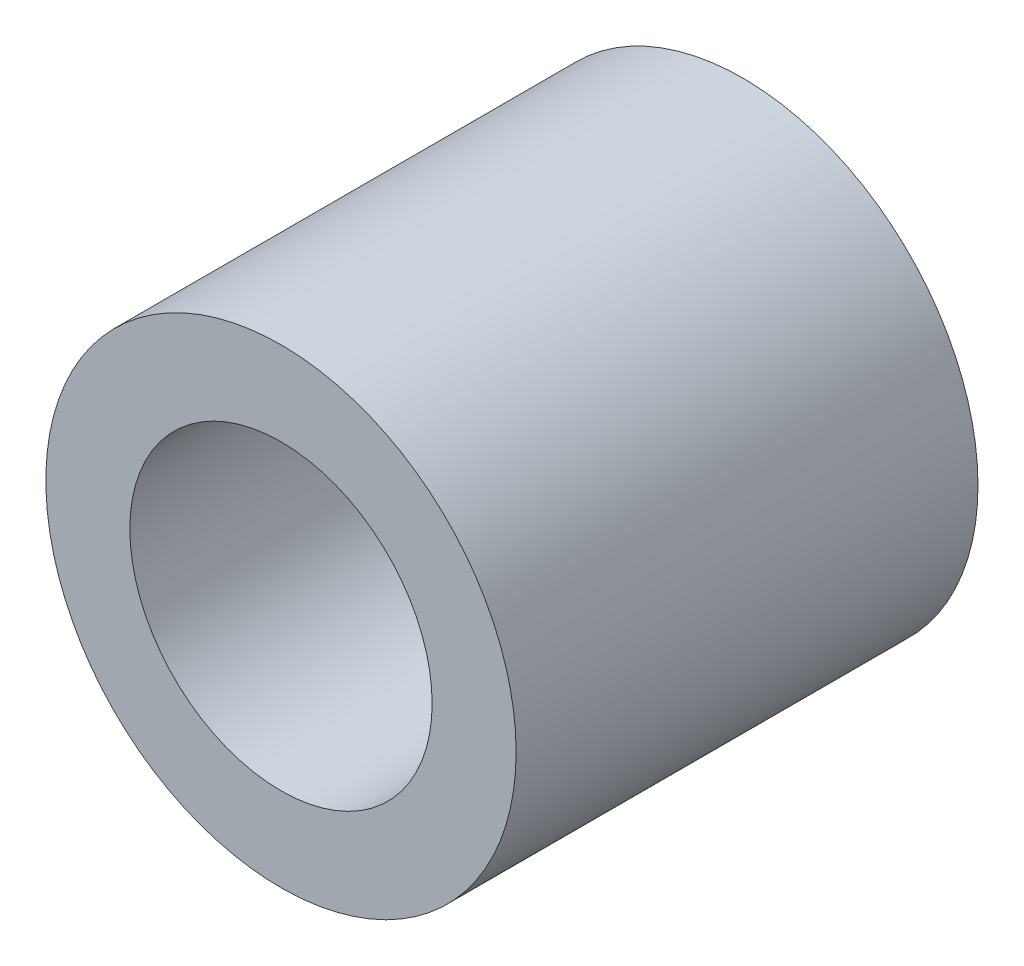
ISO-10303-21;
HEADER;
FILE_DESCRIPTION(('STEP AP214'),'2;1');
FILE_NAME('part.step','',(''),(''),'','','');
FILE_SCHEMA(('AUTOMOTIVE_DESIGN { 1 0 10303 214 1 1 1 1 }'));
ENDSEC;
DATA;
#1=APPLICATION_CONTEXT('core data for automotive mechanical design processes');
#2=APPLICATION_PROTOCOL_DEFINITION('international standard','automotive_design',2000,#1);
#3=PRODUCT_CONTEXT('',#1,'mechanical');
#4=PRODUCT('Part','Part','',(#3));
#5=PRODUCT_RELATED_PRODUCT_CATEGORY('part','',(#4));
#6=PRODUCT_DEFINITION_FORMATION('','',#4);
#7=PRODUCT_DEFINITION_CONTEXT('part definition',#1,'design');
#8=PRODUCT_DEFINITION('design','',#6,#7);
#9=PRODUCT_DEFINITION_SHAPE('','',#8);
#10=(LENGTH_UNIT() NAMED_UNIT(*) SI_UNIT(.MILLI.,.METRE.));
#11=(NAMED_UNIT(*) PLANE_ANGLE_UNIT() SI_UNIT($,.RADIAN.));
#12=(NAMED_UNIT(*) SI_UNIT($,.STERADIAN.) SOLID_ANGLE_UNIT());
#13=UNCERTAINTY_MEASURE_WITH_UNIT(LENGTH_MEASURE(1.E-05),#10,'distance_accuracy_value','');
#14=(GEOMETRIC_REPRESENTATION_CONTEXT(3) GLOBAL_UNCERTAINTY_ASSIGNED_CONTEXT((#13)) GLOBAL_UNIT_ASSIGNED_CONTEXT((#10,
#11,#12)) REPRESENTATION_CONTEXT('',''));
#15=CARTESIAN_POINT('',(0.,0.,0.));
#16=DIRECTION('',(0.,0.,1.));
#17=DIRECTION('',(1.,0.,0.));
#18=AXIS2_PLACEMENT_3D('',#15,#16,#17);
#19=CARTESIAN_POINT('',(0.,0.,5.5));
#20=DIRECTION('',(0.,0.,1.));
#21=DIRECTION('',(1.,0.,0.));
#22=AXIS2_PLACEMENT_3D('',#19,#20,#21);
#23=PLANE('',#22);
#24=CARTESIAN_POINT('',(0.,0.,5.5));
#25=DIRECTION('',(0.,0.,1.));
#26=DIRECTION('',(1.,0.,0.));
#27=AXIS2_PLACEMENT_3D('',#24,#25,#26);
#28=CIRCLE('',#27,2.8);
#29=CARTESIAN_POINT('',(2.8,0.,5.5));
#30=VERTEX_POINT('',#29);
#31=EDGE_CURVE('E10',#30,#30,#28,.T.);
#32=ORIENTED_EDGE('',*,*,#31,.T.);
#33=EDGE_LOOP('',(#32));
#34=FACE_BOUND('',#33,.T.);
#35=CARTESIAN_POINT('',(0.,0.,5.5));
#36=DIRECTION('',(0.,0.,1.));
#37=DIRECTION('',(1.,0.,0.));
#38=AXIS2_PLACEMENT_3D('',#35,#36,#37);
#39=CIRCLE('',#38,1.8);
#40=CARTESIAN_POINT('',(1.8,0.,5.5));
#41=VERTEX_POINT('',#40);
#42=EDGE_CURVE('E48',#41,#41,#39,.T.);
#43=ORIENTED_EDGE('',*,*,#42,.F.);
#44=EDGE_LOOP('',(#43));
#45=FACE_BOUND('',#44,.T.);
#46=ADVANCED_FACE('F37',(#34,#45),#23,.T.);
#47=CARTESIAN_POINT('',(0.,0.,0.));
#48=DIRECTION('',(0.,0.,1.));
#49=DIRECTION('',(1.,0.,0.));
#50=AXIS2_PLACEMENT_3D('',#47,#48,#49);
#51=PLANE('',#50);
#52=CARTESIAN_POINT('',(0.,0.,0.));
#53=DIRECTION('',(0.,0.,1.));
#54=DIRECTION('',(1.,0.,0.));
#55=AXIS2_PLACEMENT_3D('',#52,#53,#54);
#56=CIRCLE('',#55,2.8);
#57=CARTESIAN_POINT('',(2.8,0.,0.));
#58=VERTEX_POINT('',#57);
#59=EDGE_CURVE('E41',#58,#58,#56,.T.);
#60=ORIENTED_EDGE('',*,*,#59,.F.);
#61=EDGE_LOOP('',(#60));
#62=FACE_BOUND('',#61,.T.);
#63=CARTESIAN_POINT('',(0.,0.,0.));
#64=DIRECTION('',(0.,0.,1.));
#65=DIRECTION('',(1.,0.,0.));
#66=AXIS2_PLACEMENT_3D('',#63,#64,#65);
#67=CIRCLE('',#66,1.8);
#68=CARTESIAN_POINT('',(1.8,0.,0.));
#69=VERTEX_POINT('',#68);
#70=EDGE_CURVE('E50',#69,#69,#67,.T.);
#71=ORIENTED_EDGE('',*,*,#70,.T.);
#72=EDGE_LOOP('',(#71));
#73=FACE_BOUND('',#72,.T.);
#74=ADVANCED_FACE('F60',(#62,#73),#51,.F.);
#75=CARTESIAN_POINT('',(0.,0.,5.5));
#76=DIRECTION('',(0.,0.,-1.));
#77=DIRECTION('',(-1.,0.,0.));
#78=AXIS2_PLACEMENT_3D('',#75,#76,#77);
#79=CYLINDRICAL_SURFACE('',#78,2.8);
#80=ORIENTED_EDGE('',*,*,#31,.F.);
#81=EDGE_LOOP('',(#80));
#82=FACE_BOUND('',#81,.T.);
#83=ORIENTED_EDGE('',*,*,#59,.T.);
#84=EDGE_LOOP('',(#83));
#85=FACE_BOUND('',#84,.T.);
#86=ADVANCED_FACE('F39',(#82,#85),#79,.T.);
#87=CARTESIAN_POINT('',(0.,0.,5.5));
#88=DIRECTION('',(0.,0.,-1.));
#89=DIRECTION('',(-1.,0.,0.));
#90=AXIS2_PLACEMENT_3D('',#87,#88,#89);
#91=CYLINDRICAL_SURFACE('',#90,1.8);
#92=ORIENTED_EDGE('',*,*,#42,.T.);
#93=EDGE_LOOP('',(#92));
#94=FACE_BOUND('',#93,.T.);
#95=ORIENTED_EDGE('',*,*,#70,.F.);
#96=EDGE_LOOP('',(#95));
#97=FACE_BOUND('',#96,.T.);
#98=ADVANCED_FACE('F56',(#94,#97),#91,.F.);
#99=CLOSED_SHELL('',(#46,#74,#86,#98));
#100=MANIFOLD_SOLID_BREP('B2',#99);
#101=ADVANCED_BREP_SHAPE_REPRESENTATION('',(#18,#100),#14);
#102=SHAPE_DEFINITION_REPRESENTATION(#9,#101);
ENDSEC;
END-ISO-10303-21;
